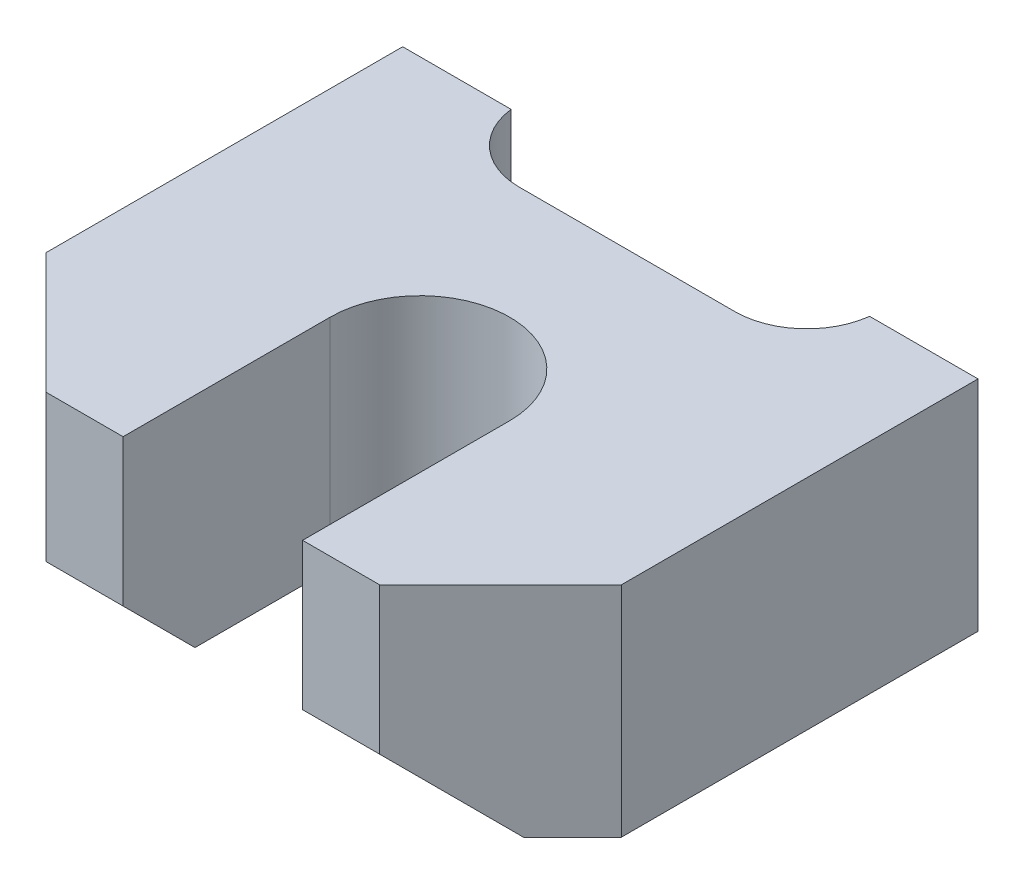
ISO-10303-21;
HEADER;
FILE_DESCRIPTION(('STEP AP214'),'2;1');
FILE_NAME('part.step','',(''),(''),'','','');
FILE_SCHEMA(('AUTOMOTIVE_DESIGN { 1 0 10303 214 1 1 1 1 }'));
ENDSEC;
DATA;
#1=APPLICATION_CONTEXT('core data for automotive mechanical design processes');
#2=APPLICATION_PROTOCOL_DEFINITION('international standard','automotive_design',2000,#1);
#3=PRODUCT_CONTEXT('',#1,'mechanical');
#4=PRODUCT('Part','Part','',(#3));
#5=PRODUCT_RELATED_PRODUCT_CATEGORY('part','',(#4));
#6=PRODUCT_DEFINITION_FORMATION('','',#4);
#7=PRODUCT_DEFINITION_CONTEXT('part definition',#1,'design');
#8=PRODUCT_DEFINITION('design','',#6,#7);
#9=PRODUCT_DEFINITION_SHAPE('','',#8);
#10=(LENGTH_UNIT() NAMED_UNIT(*) SI_UNIT(.MILLI.,.METRE.));
#11=(NAMED_UNIT(*) PLANE_ANGLE_UNIT() SI_UNIT($,.RADIAN.));
#12=(NAMED_UNIT(*) SI_UNIT($,.STERADIAN.) SOLID_ANGLE_UNIT());
#13=UNCERTAINTY_MEASURE_WITH_UNIT(LENGTH_MEASURE(1.E-05),#10,'distance_accuracy_value','');
#14=(GEOMETRIC_REPRESENTATION_CONTEXT(3) GLOBAL_UNCERTAINTY_ASSIGNED_CONTEXT((#13)) GLOBAL_UNIT_ASSIGNED_CONTEXT((#10,
#11,#12)) REPRESENTATION_CONTEXT('',''));
#15=CARTESIAN_POINT('',(0.,0.,0.));
#16=DIRECTION('',(0.,0.,1.));
#17=DIRECTION('',(1.,0.,0.));
#18=AXIS2_PLACEMENT_3D('',#15,#16,#17);
#19=CARTESIAN_POINT('',(-12.7,-9.652,7.366));
#20=DIRECTION('',(0.,-0.707106781186548,0.707106781186548));
#21=DIRECTION('',(0.,-0.707106781186548,-0.707106781186548));
#22=AXIS2_PLACEMENT_3D('',#19,#20,#21);
#23=PLANE('',#22);
#24=DIRECTION('',(-0.577350269189626,0.577350269189626,0.577350269189625));
#25=VECTOR('',#24,1.);
#26=CARTESIAN_POINT('',(10.541,-9.652,7.366));
#27=LINE('',#26,#25);
#28=CARTESIAN_POINT('',(10.541,-9.652,7.366));
#29=VERTEX_POINT('',#28);
#30=CARTESIAN_POINT('',(7.366,-6.477,10.541));
#31=VERTEX_POINT('',#30);
#32=EDGE_CURVE('E228',#29,#31,#27,.T.);
#33=ORIENTED_EDGE('',*,*,#32,.T.);
#34=DIRECTION('',(-1.,0.,0.));
#35=VECTOR('',#34,1.);
#36=CARTESIAN_POINT('',(12.7,-6.477,10.541));
#37=LINE('',#36,#35);
#38=CARTESIAN_POINT('',(3.9624,-6.47700000000001,10.541));
#39=VERTEX_POINT('',#38);
#40=EDGE_CURVE('E223',#31,#39,#37,.T.);
#41=ORIENTED_EDGE('',*,*,#40,.T.);
#42=DIRECTION('',(0.,-0.707106781186547,-0.707106781186548));
#43=VECTOR('',#42,1.);
#44=CARTESIAN_POINT('',(3.9624,-6.477,10.541));
#45=LINE('',#44,#43);
#46=CARTESIAN_POINT('',(3.9624,-9.652,7.366));
#47=VERTEX_POINT('',#46);
#48=EDGE_CURVE('E212',#39,#47,#45,.T.);
#49=ORIENTED_EDGE('',*,*,#48,.T.);
#50=DIRECTION('',(1.,0.,0.));
#51=VECTOR('',#50,1.);
#52=CARTESIAN_POINT('',(-12.7,-9.652,7.366));
#53=LINE('',#52,#51);
#54=EDGE_CURVE('E201',#29,#47,#53,.F.);
#55=ORIENTED_EDGE('',*,*,#54,.F.);
#56=EDGE_LOOP('',(#33,#41,#49,#55));
#57=FACE_BOUND('',#56,.T.);
#58=ADVANCED_FACE('F17',(#57),#23,.T.);
#59=CARTESIAN_POINT('',(-12.7,-9.652,-10.541));
#60=DIRECTION('',(0.,-1.,0.));
#61=DIRECTION('',(0.,0.,-1.));
#62=AXIS2_PLACEMENT_3D('',#59,#60,#61);
#63=PLANE('',#62);
#64=DIRECTION('',(0.,0.,-1.));
#65=VECTOR('',#64,1.);
#66=CARTESIAN_POINT('',(3.9624,-9.65199999999999,1.397));
#67=LINE('',#66,#65);
#68=CARTESIAN_POINT('',(3.9624,-9.65199999999999,1.397));
#69=VERTEX_POINT('',#68);
#70=EDGE_CURVE('E209',#47,#69,#67,.T.);
#71=ORIENTED_EDGE('',*,*,#70,.T.);
#72=CARTESIAN_POINT('',(0.,-9.65199999999999,1.397));
#73=DIRECTION('',(0.,1.,0.));
#74=DIRECTION('',(0.,0.,1.));
#75=AXIS2_PLACEMENT_3D('',#72,#73,#74);
#76=CIRCLE('',#75,3.9624);
#77=CARTESIAN_POINT('',(-3.9624,-9.65199999999999,1.397));
#78=VERTEX_POINT('',#77);
#79=EDGE_CURVE('E267',#69,#78,#76,.T.);
#80=ORIENTED_EDGE('',*,*,#79,.T.);
#81=DIRECTION('',(0.,0.,1.));
#82=VECTOR('',#81,1.);
#83=CARTESIAN_POINT('',(-3.9624,-9.65199999999999,1.397));
#84=LINE('',#83,#82);
#85=CARTESIAN_POINT('',(-3.9624,-9.652,7.366));
#86=VERTEX_POINT('',#85);
#87=EDGE_CURVE('E187',#78,#86,#84,.T.);
#88=ORIENTED_EDGE('',*,*,#87,.T.);
#89=DIRECTION('',(1.,0.,0.));
#90=VECTOR('',#89,1.);
#91=CARTESIAN_POINT('',(-12.7,-9.652,7.366));
#92=LINE('',#91,#90);
#93=CARTESIAN_POINT('',(-10.541,-9.652,7.366));
#94=VERTEX_POINT('',#93);
#95=EDGE_CURVE('E199',#94,#86,#92,.T.);
#96=ORIENTED_EDGE('',*,*,#95,.F.);
#97=DIRECTION('',(-0.707106781186548,0.,-0.707106781186548));
#98=VECTOR('',#97,1.);
#99=CARTESIAN_POINT('',(-12.7,-9.652,5.207));
#100=LINE('',#99,#98);
#101=CARTESIAN_POINT('',(-12.7,-9.652,5.207));
#102=VERTEX_POINT('',#101);
#103=EDGE_CURVE('E196',#94,#102,#100,.T.);
#104=ORIENTED_EDGE('',*,*,#103,.T.);
#105=DIRECTION('',(0.,0.,-1.));
#106=VECTOR('',#105,1.);
#107=CARTESIAN_POINT('',(-12.7,-9.652,10.541));
#108=LINE('',#107,#106);
#109=CARTESIAN_POINT('',(-12.7,-9.652,-10.541));
#110=VERTEX_POINT('',#109);
#111=EDGE_CURVE('E159',#102,#110,#108,.T.);
#112=ORIENTED_EDGE('',*,*,#111,.T.);
#113=DIRECTION('',(1.,0.,0.));
#114=VECTOR('',#113,1.);
#115=CARTESIAN_POINT('',(-12.7,-9.652,-10.541));
#116=LINE('',#115,#114);
#117=CARTESIAN_POINT('',(-7.91455710608168,-9.652,-10.541));
#118=VERTEX_POINT('',#117);
#119=EDGE_CURVE('E144',#110,#118,#116,.T.);
#120=ORIENTED_EDGE('',*,*,#119,.T.);
#121=CARTESIAN_POINT('',(-4.7625,-9.652,-10.922));
#122=DIRECTION('',(0.,1.,0.));
#123=DIRECTION('',(0.,0.,1.));
#124=AXIS2_PLACEMENT_3D('',#121,#122,#123);
#125=CIRCLE('',#124,3.175);
#126=CARTESIAN_POINT('',(-4.7625,-9.652,-7.747));
#127=VERTEX_POINT('',#126);
#128=EDGE_CURVE('E20',#118,#127,#125,.T.);
#129=ORIENTED_EDGE('',*,*,#128,.T.);
#130=DIRECTION('',(-1.,0.,0.));
#131=VECTOR('',#130,1.);
#132=CARTESIAN_POINT('',(-4.7625,-9.652,-7.747));
#133=LINE('',#132,#131);
#134=CARTESIAN_POINT('',(4.7625,-9.652,-7.747));
#135=VERTEX_POINT('',#134);
#136=EDGE_CURVE('E131',#135,#127,#133,.T.);
#137=ORIENTED_EDGE('',*,*,#136,.F.);
#138=CARTESIAN_POINT('',(4.7625,-9.652,-10.922));
#139=DIRECTION('',(0.,1.,0.));
#140=DIRECTION('',(0.,0.,1.));
#141=AXIS2_PLACEMENT_3D('',#138,#139,#140);
#142=CIRCLE('',#141,3.175);
#143=CARTESIAN_POINT('',(7.91455710608167,-9.652,-10.541));
#144=VERTEX_POINT('',#143);
#145=EDGE_CURVE('E151',#135,#144,#142,.T.);
#146=ORIENTED_EDGE('',*,*,#145,.T.);
#147=DIRECTION('',(1.,0.,0.));
#148=VECTOR('',#147,1.);
#149=CARTESIAN_POINT('',(-12.7,-9.652,-10.541));
#150=LINE('',#149,#148);
#151=CARTESIAN_POINT('',(12.7,-9.652,-10.541));
#152=VERTEX_POINT('',#151);
#153=EDGE_CURVE('E243',#144,#152,#150,.T.);
#154=ORIENTED_EDGE('',*,*,#153,.T.);
#155=DIRECTION('',(0.,0.,1.));
#156=VECTOR('',#155,1.);
#157=CARTESIAN_POINT('',(12.7,-9.652,-10.541));
#158=LINE('',#157,#156);
#159=CARTESIAN_POINT('',(12.7,-9.652,5.207));
#160=VERTEX_POINT('',#159);
#161=EDGE_CURVE('E231',#152,#160,#158,.T.);
#162=ORIENTED_EDGE('',*,*,#161,.T.);
#163=DIRECTION('',(-0.707106781186548,0.,0.707106781186547));
#164=VECTOR('',#163,1.);
#165=CARTESIAN_POINT('',(7.366,-9.652,10.541));
#166=LINE('',#165,#164);
#167=EDGE_CURVE('E238',#160,#29,#166,.T.);
#168=ORIENTED_EDGE('',*,*,#167,.T.);
#169=ORIENTED_EDGE('',*,*,#54,.T.);
#170=EDGE_LOOP('',(#71,#80,#88,#96,#104,#112,#120,#129,#137,#146,#154,#162,#168,#169));
#171=FACE_BOUND('',#170,.T.);
#172=ADVANCED_FACE('F142',(#171),#63,.T.);
#173=CARTESIAN_POINT('',(-12.7,-9.652,7.366));
#174=DIRECTION('',(0.,-0.707106781186548,0.707106781186548));
#175=DIRECTION('',(0.,-0.707106781186548,-0.707106781186548));
#176=AXIS2_PLACEMENT_3D('',#173,#174,#175);
#177=PLANE('',#176);
#178=DIRECTION('',(-0.577350269189626,-0.577350269189626,-0.577350269189626));
#179=VECTOR('',#178,1.);
#180=CARTESIAN_POINT('',(-7.366,-6.477,10.541));
#181=LINE('',#180,#179);
#182=CARTESIAN_POINT('',(-7.366,-6.477,10.541));
#183=VERTEX_POINT('',#182);
#184=EDGE_CURVE('E172',#183,#94,#181,.T.);
#185=ORIENTED_EDGE('',*,*,#184,.T.);
#186=ORIENTED_EDGE('',*,*,#95,.T.);
#187=DIRECTION('',(0.,0.707106781186547,0.707106781186548));
#188=VECTOR('',#187,1.);
#189=CARTESIAN_POINT('',(-3.9624,-9.65199999999999,7.366));
#190=LINE('',#189,#188);
#191=CARTESIAN_POINT('',(-3.9624,-6.477,10.541));
#192=VERTEX_POINT('',#191);
#193=EDGE_CURVE('E183',#86,#192,#190,.T.);
#194=ORIENTED_EDGE('',*,*,#193,.T.);
#195=DIRECTION('',(-1.,0.,0.));
#196=VECTOR('',#195,1.);
#197=CARTESIAN_POINT('',(12.7,-6.477,10.541));
#198=LINE('',#197,#196);
#199=EDGE_CURVE('E177',#192,#183,#198,.T.);
#200=ORIENTED_EDGE('',*,*,#199,.T.);
#201=EDGE_LOOP('',(#185,#186,#194,#200));
#202=FACE_BOUND('',#201,.T.);
#203=ADVANCED_FACE('F406',(#202),#177,.T.);
#204=CARTESIAN_POINT('',(-12.7,-9.652,5.207));
#205=DIRECTION('',(0.707106781186548,0.,-0.707106781186548));
#206=DIRECTION('',(-0.707106781186548,0.,-0.707106781186548));
#207=AXIS2_PLACEMENT_3D('',#204,#205,#206);
#208=PLANE('',#207);
#209=DIRECTION('',(0.,1.,0.));
#210=VECTOR('',#209,1.);
#211=CARTESIAN_POINT('',(-7.366,-9.652,10.541));
#212=LINE('',#211,#210);
#213=CARTESIAN_POINT('',(-7.366,0.,10.541));
#214=VERTEX_POINT('',#213);
#215=EDGE_CURVE('E180',#183,#214,#212,.T.);
#216=ORIENTED_EDGE('',*,*,#215,.T.);
#217=DIRECTION('',(-0.707106781186547,0.,-0.707106781186548));
#218=VECTOR('',#217,1.);
#219=CARTESIAN_POINT('',(-7.366,0.,10.541));
#220=LINE('',#219,#218);
#221=CARTESIAN_POINT('',(-12.7,0.,5.207));
#222=VERTEX_POINT('',#221);
#223=EDGE_CURVE('E166',#214,#222,#220,.T.);
#224=ORIENTED_EDGE('',*,*,#223,.T.);
#225=DIRECTION('',(0.,1.,0.));
#226=VECTOR('',#225,1.);
#227=CARTESIAN_POINT('',(-12.7,-9.652,5.207));
#228=LINE('',#227,#226);
#229=EDGE_CURVE('E169',#222,#102,#228,.F.);
#230=ORIENTED_EDGE('',*,*,#229,.T.);
#231=ORIENTED_EDGE('',*,*,#103,.F.);
#232=ORIENTED_EDGE('',*,*,#184,.F.);
#233=EDGE_LOOP('',(#216,#224,#230,#231,#232));
#234=FACE_BOUND('',#233,.T.);
#235=ADVANCED_FACE('F369',(#234),#208,.F.);
#236=CARTESIAN_POINT('',(-12.7,-9.652,10.541));
#237=DIRECTION('',(1.,0.,0.));
#238=DIRECTION('',(0.,0.,-1.));
#239=AXIS2_PLACEMENT_3D('',#236,#237,#238);
#240=PLANE('',#239);
#241=ORIENTED_EDGE('',*,*,#229,.F.);
#242=DIRECTION('',(0.,0.,-1.));
#243=VECTOR('',#242,1.);
#244=CARTESIAN_POINT('',(-12.7,0.,-10.541));
#245=LINE('',#244,#243);
#246=CARTESIAN_POINT('',(-12.7,0.,-10.541));
#247=VERTEX_POINT('',#246);
#248=EDGE_CURVE('E162',#222,#247,#245,.T.);
#249=ORIENTED_EDGE('',*,*,#248,.T.);
#250=DIRECTION('',(0.,1.,0.));
#251=VECTOR('',#250,1.);
#252=CARTESIAN_POINT('',(-12.7,-9.652,-10.541));
#253=LINE('',#252,#251);
#254=EDGE_CURVE('E156',#247,#110,#253,.F.);
#255=ORIENTED_EDGE('',*,*,#254,.T.);
#256=ORIENTED_EDGE('',*,*,#111,.F.);
#257=EDGE_LOOP('',(#241,#249,#255,#256));
#258=FACE_BOUND('',#257,.T.);
#259=ADVANCED_FACE('F367',(#258),#240,.F.);
#260=CARTESIAN_POINT('',(-12.7,-9.652,-10.541));
#261=DIRECTION('',(0.,0.,1.));
#262=DIRECTION('',(1.,0.,0.));
#263=AXIS2_PLACEMENT_3D('',#260,#261,#262);
#264=PLANE('',#263);
#265=ORIENTED_EDGE('',*,*,#119,.F.);
#266=ORIENTED_EDGE('',*,*,#254,.F.);
#267=DIRECTION('',(1.,0.,0.));
#268=VECTOR('',#267,1.);
#269=CARTESIAN_POINT('',(-12.7,0.,-10.541));
#270=LINE('',#269,#268);
#271=CARTESIAN_POINT('',(-7.91455710608168,0.,-10.541));
#272=VERTEX_POINT('',#271);
#273=EDGE_CURVE('E165',#247,#272,#270,.T.);
#274=ORIENTED_EDGE('',*,*,#273,.T.);
#275=DIRECTION('',(0.,1.,0.));
#276=VECTOR('',#275,1.);
#277=CARTESIAN_POINT('',(-7.91455710608168,47.498,-10.541));
#278=LINE('',#277,#276);
#279=EDGE_CURVE('E140',#272,#118,#278,.F.);
#280=ORIENTED_EDGE('',*,*,#279,.T.);
#281=EDGE_LOOP('',(#265,#266,#274,#280));
#282=FACE_BOUND('',#281,.T.);
#283=ADVANCED_FACE('F364',(#282),#264,.F.);
#284=CARTESIAN_POINT('',(-4.7625,47.498,-10.922));
#285=DIRECTION('',(0.,1.,0.));
#286=DIRECTION('',(0.,0.,1.));
#287=AXIS2_PLACEMENT_3D('',#284,#285,#286);
#288=CYLINDRICAL_SURFACE('',#287,3.175);
#289=CARTESIAN_POINT('',(-4.7625,0.,-10.922));
#290=DIRECTION('',(0.,1.,0.));
#291=DIRECTION('',(0.,0.,1.));
#292=AXIS2_PLACEMENT_3D('',#289,#290,#291);
#293=CIRCLE('',#292,3.175);
#294=CARTESIAN_POINT('',(-4.7625,0.,-7.747));
#295=VERTEX_POINT('',#294);
#296=EDGE_CURVE('E149',#272,#295,#293,.T.);
#297=ORIENTED_EDGE('',*,*,#296,.T.);
#298=DIRECTION('',(0.,1.,0.));
#299=VECTOR('',#298,1.);
#300=CARTESIAN_POINT('',(-4.7625,47.498,-7.747));
#301=LINE('',#300,#299);
#302=EDGE_CURVE('E134',#127,#295,#301,.T.);
#303=ORIENTED_EDGE('',*,*,#302,.F.);
#304=ORIENTED_EDGE('',*,*,#128,.F.);
#305=ORIENTED_EDGE('',*,*,#279,.F.);
#306=EDGE_LOOP('',(#297,#303,#304,#305));
#307=FACE_BOUND('',#306,.T.);
#308=ADVANCED_FACE('F147',(#307),#288,.F.);
#309=CARTESIAN_POINT('',(-4.7625,47.498,-7.747));
#310=DIRECTION('',(0.,0.,-1.));
#311=DIRECTION('',(-1.,0.,0.));
#312=AXIS2_PLACEMENT_3D('',#309,#310,#311);
#313=PLANE('',#312);
#314=ORIENTED_EDGE('',*,*,#136,.T.);
#315=ORIENTED_EDGE('',*,*,#302,.T.);
#316=DIRECTION('',(1.,0.,0.));
#317=VECTOR('',#316,1.);
#318=CARTESIAN_POINT('',(-12.7,0.,-7.747));
#319=LINE('',#318,#317);
#320=CARTESIAN_POINT('',(4.7625,0.,-7.747));
#321=VERTEX_POINT('',#320);
#322=EDGE_CURVE('E265',#295,#321,#319,.T.);
#323=ORIENTED_EDGE('',*,*,#322,.T.);
#324=DIRECTION('',(0.,1.,0.));
#325=VECTOR('',#324,1.);
#326=CARTESIAN_POINT('',(4.7625,47.498,-7.747));
#327=LINE('',#326,#325);
#328=EDGE_CURVE('E136',#321,#135,#327,.F.);
#329=ORIENTED_EDGE('',*,*,#328,.T.);
#330=EDGE_LOOP('',(#314,#315,#323,#329));
#331=FACE_BOUND('',#330,.T.);
#332=ADVANCED_FACE('F132',(#331),#313,.T.);
#333=CARTESIAN_POINT('',(4.7625,47.498,-10.922));
#334=DIRECTION('',(0.,1.,0.));
#335=DIRECTION('',(0.,0.,1.));
#336=AXIS2_PLACEMENT_3D('',#333,#334,#335);
#337=CYLINDRICAL_SURFACE('',#336,3.175);
#338=ORIENTED_EDGE('',*,*,#145,.F.);
#339=ORIENTED_EDGE('',*,*,#328,.F.);
#340=CARTESIAN_POINT('',(4.7625,0.,-10.922));
#341=DIRECTION('',(0.,1.,0.));
#342=DIRECTION('',(0.,0.,1.));
#343=AXIS2_PLACEMENT_3D('',#340,#341,#342);
#344=CIRCLE('',#343,3.175);
#345=CARTESIAN_POINT('',(7.91455710608167,0.,-10.541));
#346=VERTEX_POINT('',#345);
#347=EDGE_CURVE('E261',#321,#346,#344,.T.);
#348=ORIENTED_EDGE('',*,*,#347,.T.);
#349=DIRECTION('',(0.,1.,0.));
#350=VECTOR('',#349,1.);
#351=CARTESIAN_POINT('',(7.91455710608167,-9.652,-10.541));
#352=LINE('',#351,#350);
#353=EDGE_CURVE('E245',#346,#144,#352,.F.);
#354=ORIENTED_EDGE('',*,*,#353,.T.);
#355=EDGE_LOOP('',(#338,#339,#348,#354));
#356=FACE_BOUND('',#355,.T.);
#357=ADVANCED_FACE('F271',(#356),#337,.F.);
#358=CARTESIAN_POINT('',(-12.7,-9.652,-10.541));
#359=DIRECTION('',(0.,0.,1.));
#360=DIRECTION('',(1.,0.,0.));
#361=AXIS2_PLACEMENT_3D('',#358,#359,#360);
#362=PLANE('',#361);
#363=DIRECTION('',(1.,0.,0.));
#364=VECTOR('',#363,1.);
#365=CARTESIAN_POINT('',(-12.7,0.,-10.541));
#366=LINE('',#365,#364);
#367=CARTESIAN_POINT('',(12.7,0.,-10.541));
#368=VERTEX_POINT('',#367);
#369=EDGE_CURVE('E264',#346,#368,#366,.T.);
#370=ORIENTED_EDGE('',*,*,#369,.T.);
#371=DIRECTION('',(0.,1.,0.));
#372=VECTOR('',#371,1.);
#373=CARTESIAN_POINT('',(12.7,-9.652,-10.541));
#374=LINE('',#373,#372);
#375=EDGE_CURVE('E235',#368,#152,#374,.F.);
#376=ORIENTED_EDGE('',*,*,#375,.T.);
#377=ORIENTED_EDGE('',*,*,#153,.F.);
#378=ORIENTED_EDGE('',*,*,#353,.F.);
#379=EDGE_LOOP('',(#370,#376,#377,#378));
#380=FACE_BOUND('',#379,.T.);
#381=ADVANCED_FACE('F360',(#380),#362,.F.);
#382=CARTESIAN_POINT('',(12.7,-9.652,-10.541));
#383=DIRECTION('',(-1.,0.,0.));
#384=DIRECTION('',(0.,0.,1.));
#385=AXIS2_PLACEMENT_3D('',#382,#383,#384);
#386=PLANE('',#385);
#387=DIRECTION('',(0.,1.,0.));
#388=VECTOR('',#387,1.);
#389=CARTESIAN_POINT('',(12.7,-9.652,5.207));
#390=LINE('',#389,#388);
#391=CARTESIAN_POINT('',(12.7,0.,5.207));
#392=VERTEX_POINT('',#391);
#393=EDGE_CURVE('E230',#392,#160,#390,.F.);
#394=ORIENTED_EDGE('',*,*,#393,.T.);
#395=ORIENTED_EDGE('',*,*,#161,.F.);
#396=ORIENTED_EDGE('',*,*,#375,.F.);
#397=DIRECTION('',(0.,0.,-1.));
#398=VECTOR('',#397,1.);
#399=CARTESIAN_POINT('',(12.7,0.,-10.541));
#400=LINE('',#399,#398);
#401=EDGE_CURVE('E283',#368,#392,#400,.F.);
#402=ORIENTED_EDGE('',*,*,#401,.T.);
#403=EDGE_LOOP('',(#394,#395,#396,#402));
#404=FACE_BOUND('',#403,.T.);
#405=ADVANCED_FACE('F359',(#404),#386,.F.);
#406=CARTESIAN_POINT('',(7.366,-9.652,10.541));
#407=DIRECTION('',(-0.707106781186547,0.,-0.707106781186548));
#408=DIRECTION('',(-0.707106781186548,0.,0.707106781186547));
#409=AXIS2_PLACEMENT_3D('',#406,#407,#408);
#410=PLANE('',#409);
#411=ORIENTED_EDGE('',*,*,#393,.F.);
#412=DIRECTION('',(-0.707106781186547,0.,0.707106781186548));
#413=VECTOR('',#412,1.);
#414=CARTESIAN_POINT('',(12.7,0.,5.207));
#415=LINE('',#414,#413);
#416=CARTESIAN_POINT('',(7.366,0.,10.541));
#417=VERTEX_POINT('',#416);
#418=EDGE_CURVE('E286',#392,#417,#415,.T.);
#419=ORIENTED_EDGE('',*,*,#418,.T.);
#420=DIRECTION('',(0.,1.,0.));
#421=VECTOR('',#420,1.);
#422=CARTESIAN_POINT('',(7.366,-9.652,10.541));
#423=LINE('',#422,#421);
#424=EDGE_CURVE('E225',#417,#31,#423,.F.);
#425=ORIENTED_EDGE('',*,*,#424,.T.);
#426=ORIENTED_EDGE('',*,*,#32,.F.);
#427=ORIENTED_EDGE('',*,*,#167,.F.);
#428=EDGE_LOOP('',(#411,#419,#425,#426,#427));
#429=FACE_BOUND('',#428,.T.);
#430=ADVANCED_FACE('F354',(#429),#410,.F.);
#431=CARTESIAN_POINT('',(12.7,-9.652,10.541));
#432=DIRECTION('',(0.,0.,-1.));
#433=DIRECTION('',(-1.,0.,0.));
#434=AXIS2_PLACEMENT_3D('',#431,#432,#433);
#435=PLANE('',#434);
#436=DIRECTION('',(0.,1.,0.));
#437=VECTOR('',#436,1.);
#438=CARTESIAN_POINT('',(3.9624,101.473,10.541));
#439=LINE('',#438,#437);
#440=CARTESIAN_POINT('',(3.9624,0.,10.541));
#441=VERTEX_POINT('',#440);
#442=EDGE_CURVE('E220',#441,#39,#439,.F.);
#443=ORIENTED_EDGE('',*,*,#442,.T.);
#444=ORIENTED_EDGE('',*,*,#40,.F.);
#445=ORIENTED_EDGE('',*,*,#424,.F.);
#446=DIRECTION('',(1.,0.,0.));
#447=VECTOR('',#446,1.);
#448=CARTESIAN_POINT('',(-12.7,0.,10.541));
#449=LINE('',#448,#447);
#450=EDGE_CURVE('E295',#417,#441,#449,.F.);
#451=ORIENTED_EDGE('',*,*,#450,.T.);
#452=EDGE_LOOP('',(#443,#444,#445,#451));
#453=FACE_BOUND('',#452,.T.);
#454=ADVANCED_FACE('F351',(#453),#435,.F.);
#455=CARTESIAN_POINT('',(3.9624,101.473,1.397));
#456=DIRECTION('',(1.,0.,0.));
#457=DIRECTION('',(0.,0.,-1.));
#458=AXIS2_PLACEMENT_3D('',#455,#456,#457);
#459=PLANE('',#458);
#460=ORIENTED_EDGE('',*,*,#70,.F.);
#461=ORIENTED_EDGE('',*,*,#48,.F.);
#462=ORIENTED_EDGE('',*,*,#442,.F.);
#463=DIRECTION('',(0.,0.,-1.));
#464=VECTOR('',#463,1.);
#465=CARTESIAN_POINT('',(3.9624,0.,-10.541));
#466=LINE('',#465,#464);
#467=CARTESIAN_POINT('',(3.96240000000001,0.,1.397));
#468=VERTEX_POINT('',#467);
#469=EDGE_CURVE('E260',#441,#468,#466,.T.);
#470=ORIENTED_EDGE('',*,*,#469,.T.);
#471=DIRECTION('',(0.,1.,0.));
#472=VECTOR('',#471,1.);
#473=CARTESIAN_POINT('',(3.96240000000001,101.473,1.397));
#474=LINE('',#473,#472);
#475=EDGE_CURVE('E211',#468,#69,#474,.F.);
#476=ORIENTED_EDGE('',*,*,#475,.T.);
#477=EDGE_LOOP('',(#460,#461,#462,#470,#476));
#478=FACE_BOUND('',#477,.T.);
#479=ADVANCED_FACE('F346',(#478),#459,.F.);
#480=CARTESIAN_POINT('',(0.,101.473,1.397));
#481=DIRECTION('',(0.,1.,0.));
#482=DIRECTION('',(0.,0.,1.));
#483=AXIS2_PLACEMENT_3D('',#480,#481,#482);
#484=CYLINDRICAL_SURFACE('',#483,3.9624);
#485=ORIENTED_EDGE('',*,*,#79,.F.);
#486=ORIENTED_EDGE('',*,*,#475,.F.);
#487=CARTESIAN_POINT('',(0.,0.,1.397));
#488=DIRECTION('',(0.,1.,0.));
#489=DIRECTION('',(0.,0.,1.));
#490=AXIS2_PLACEMENT_3D('',#487,#488,#489);
#491=CIRCLE('',#490,3.9624);
#492=CARTESIAN_POINT('',(-3.9624,0.,1.397));
#493=VERTEX_POINT('',#492);
#494=EDGE_CURVE('E257',#468,#493,#491,.T.);
#495=ORIENTED_EDGE('',*,*,#494,.T.);
#496=DIRECTION('',(0.,1.,0.));
#497=VECTOR('',#496,1.);
#498=CARTESIAN_POINT('',(-3.9624,101.473,1.397));
#499=LINE('',#498,#497);
#500=EDGE_CURVE('E206',#493,#78,#499,.F.);
#501=ORIENTED_EDGE('',*,*,#500,.T.);
#502=EDGE_LOOP('',(#485,#486,#495,#501));
#503=FACE_BOUND('',#502,.T.);
#504=ADVANCED_FACE('F343',(#503),#484,.F.);
#505=CARTESIAN_POINT('',(-3.9624,101.473,1.397));
#506=DIRECTION('',(-1.,0.,0.));
#507=DIRECTION('',(0.,0.,1.));
#508=AXIS2_PLACEMENT_3D('',#505,#506,#507);
#509=PLANE('',#508);
#510=ORIENTED_EDGE('',*,*,#193,.F.);
#511=ORIENTED_EDGE('',*,*,#87,.F.);
#512=ORIENTED_EDGE('',*,*,#500,.F.);
#513=DIRECTION('',(0.,0.,-1.));
#514=VECTOR('',#513,1.);
#515=CARTESIAN_POINT('',(-3.9624,0.,-10.541));
#516=LINE('',#515,#514);
#517=CARTESIAN_POINT('',(-3.9624,0.,10.541));
#518=VERTEX_POINT('',#517);
#519=EDGE_CURVE('E26',#493,#518,#516,.F.);
#520=ORIENTED_EDGE('',*,*,#519,.T.);
#521=DIRECTION('',(0.,1.,0.));
#522=VECTOR('',#521,1.);
#523=CARTESIAN_POINT('',(-3.9624,-9.652,10.541));
#524=LINE('',#523,#522);
#525=EDGE_CURVE('E34',#518,#192,#524,.F.);
#526=ORIENTED_EDGE('',*,*,#525,.T.);
#527=EDGE_LOOP('',(#510,#511,#512,#520,#526));
#528=FACE_BOUND('',#527,.T.);
#529=ADVANCED_FACE('F335',(#528),#509,.F.);
#530=CARTESIAN_POINT('',(12.7,-9.652,10.541));
#531=DIRECTION('',(0.,0.,-1.));
#532=DIRECTION('',(-1.,0.,0.));
#533=AXIS2_PLACEMENT_3D('',#530,#531,#532);
#534=PLANE('',#533);
#535=ORIENTED_EDGE('',*,*,#525,.F.);
#536=DIRECTION('',(1.,0.,0.));
#537=VECTOR('',#536,1.);
#538=CARTESIAN_POINT('',(-12.7,0.,10.541));
#539=LINE('',#538,#537);
#540=EDGE_CURVE('E11',#518,#214,#539,.F.);
#541=ORIENTED_EDGE('',*,*,#540,.T.);
#542=ORIENTED_EDGE('',*,*,#215,.F.);
#543=ORIENTED_EDGE('',*,*,#199,.F.);
#544=EDGE_LOOP('',(#535,#541,#542,#543));
#545=FACE_BOUND('',#544,.T.);
#546=ADVANCED_FACE('F371',(#545),#534,.F.);
#547=CARTESIAN_POINT('',(-12.7,0.,-10.541));
#548=DIRECTION('',(0.,-1.,0.));
#549=DIRECTION('',(0.,0.,-1.));
#550=AXIS2_PLACEMENT_3D('',#547,#548,#549);
#551=PLANE('',#550);
#552=ORIENTED_EDGE('',*,*,#519,.F.);
#553=ORIENTED_EDGE('',*,*,#494,.F.);
#554=ORIENTED_EDGE('',*,*,#469,.F.);
#555=ORIENTED_EDGE('',*,*,#450,.F.);
#556=ORIENTED_EDGE('',*,*,#418,.F.);
#557=ORIENTED_EDGE('',*,*,#401,.F.);
#558=ORIENTED_EDGE('',*,*,#369,.F.);
#559=ORIENTED_EDGE('',*,*,#347,.F.);
#560=ORIENTED_EDGE('',*,*,#322,.F.);
#561=ORIENTED_EDGE('',*,*,#296,.F.);
#562=ORIENTED_EDGE('',*,*,#273,.F.);
#563=ORIENTED_EDGE('',*,*,#248,.F.);
#564=ORIENTED_EDGE('',*,*,#223,.F.);
#565=ORIENTED_EDGE('',*,*,#540,.F.);
#566=EDGE_LOOP('',(#552,#553,#554,#555,#556,#557,#558,#559,#560,#561,#562,#563,#564,#565));
#567=FACE_BOUND('',#566,.T.);
#568=ADVANCED_FACE('F339',(#567),#551,.F.);
#569=CLOSED_SHELL('',(#58,#172,#203,#235,#259,#283,#308,#332,#357,#381,#405,#430,#454,#479,#504,
#529,#546,#568));
#570=MANIFOLD_SOLID_BREP('B1',#569);
#571=ADVANCED_BREP_SHAPE_REPRESENTATION('',(#18,#570),#14);
#572=SHAPE_DEFINITION_REPRESENTATION(#9,#571);
ENDSEC;
END-ISO-10303-21;
